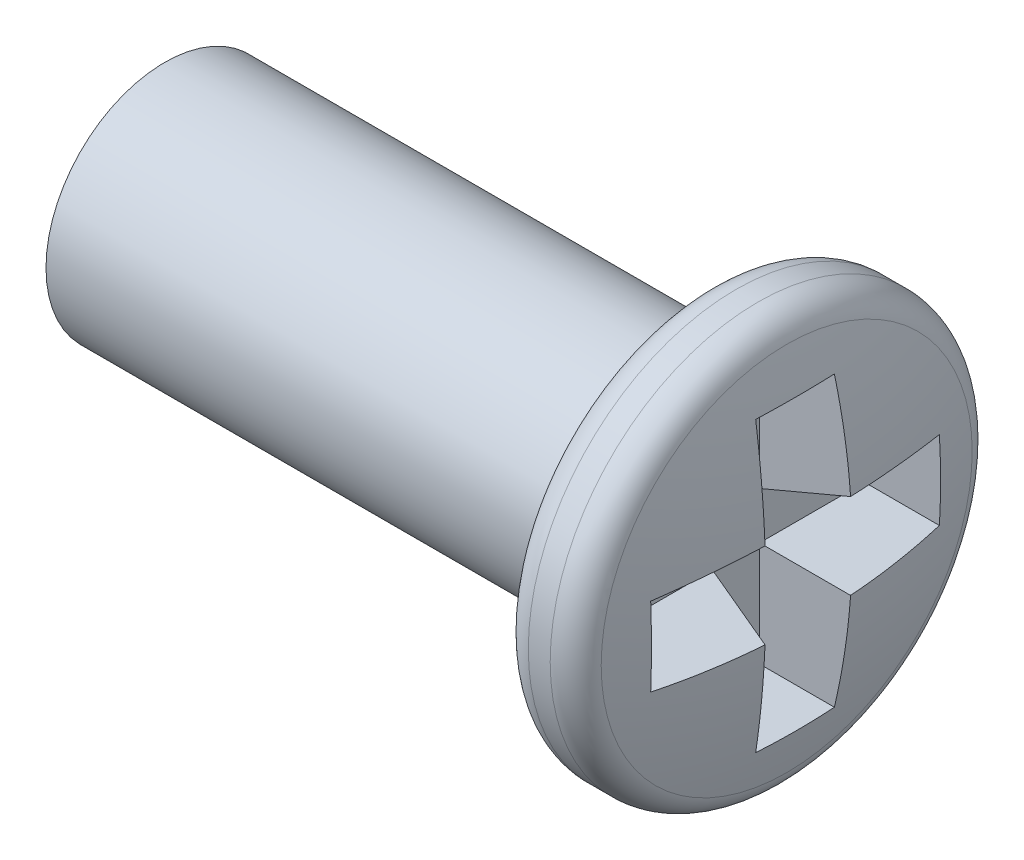
ISO-10303-21;
HEADER;
FILE_DESCRIPTION(('STEP AP214'),'2;1');
FILE_NAME('part.step','',(''),(''),'','','');
FILE_SCHEMA(('AUTOMOTIVE_DESIGN { 1 0 10303 214 1 1 1 1 }'));
ENDSEC;
DATA;
#1=APPLICATION_CONTEXT('core data for automotive mechanical design processes');
#2=APPLICATION_PROTOCOL_DEFINITION('international standard','automotive_design',2000,#1);
#3=PRODUCT_CONTEXT('',#1,'mechanical');
#4=PRODUCT('Part','Part','',(#3));
#5=PRODUCT_RELATED_PRODUCT_CATEGORY('part','',(#4));
#6=PRODUCT_DEFINITION_FORMATION('','',#4);
#7=PRODUCT_DEFINITION_CONTEXT('part definition',#1,'design');
#8=PRODUCT_DEFINITION('design','',#6,#7);
#9=PRODUCT_DEFINITION_SHAPE('','',#8);
#10=(LENGTH_UNIT() NAMED_UNIT(*) SI_UNIT(.MILLI.,.METRE.));
#11=(NAMED_UNIT(*) PLANE_ANGLE_UNIT() SI_UNIT($,.RADIAN.));
#12=(NAMED_UNIT(*) SI_UNIT($,.STERADIAN.) SOLID_ANGLE_UNIT());
#13=UNCERTAINTY_MEASURE_WITH_UNIT(LENGTH_MEASURE(1.E-05),#10,'distance_accuracy_value','');
#14=(GEOMETRIC_REPRESENTATION_CONTEXT(3) GLOBAL_UNCERTAINTY_ASSIGNED_CONTEXT((#13)) GLOBAL_UNIT_ASSIGNED_CONTEXT((#10,
#11,#12)) REPRESENTATION_CONTEXT('',''));
#15=CARTESIAN_POINT('',(0.,0.,0.));
#16=DIRECTION('',(0.,0.,1.));
#17=DIRECTION('',(1.,0.,0.));
#18=AXIS2_PLACEMENT_3D('',#15,#16,#17);
#19=CARTESIAN_POINT('',(0.,0.8,0.));
#20=DIRECTION('',(1.,0.,0.));
#21=DIRECTION('',(0.,0.,-1.));
#22=AXIS2_PLACEMENT_3D('',#19,#20,#21);
#23=PLANE('',#22);
#24=CARTESIAN_POINT('',(0.,0.,0.));
#25=DIRECTION('',(-1.,0.,0.));
#26=DIRECTION('',(0.,0.,1.));
#27=AXIS2_PLACEMENT_3D('',#24,#25,#26);
#28=CIRCLE('',#27,0.8);
#29=CARTESIAN_POINT('',(0.,0.,0.8));
#30=VERTEX_POINT('',#29);
#31=EDGE_CURVE('E127',#30,#30,#28,.T.);
#32=ORIENTED_EDGE('',*,*,#31,.T.);
#33=EDGE_LOOP('',(#32));
#34=FACE_BOUND('',#33,.T.);
#35=ADVANCED_FACE('F34',(#34),#23,.F.);
#36=CARTESIAN_POINT('',(-0.649999999999987,0.,0.));
#37=DIRECTION('',(-1.,0.,0.));
#38=DIRECTION('',(0.,1.,0.));
#39=AXIS2_PLACEMENT_3D('',#36,#37,#38);
#40=SPHERICAL_SURFACE('',#39,4.99999999999999);
#41=CARTESIAN_POINT('',(-0.388246241920137,0.,-0.976878324226091));
#42=DIRECTION('',(-0.258819045102521,0.,0.965925826289068));
#43=DIRECTION('',(0.965925826289068,0.,0.258819045102521));
#44=AXIS2_PLACEMENT_3D('',#41,#42,#43);
#45=CIRCLE('',#44,4.89665127508465);
#46=CARTESIAN_POINT('',(4.33335234348308,0.288270203716636,0.288270203716636));
#47=VERTEX_POINT('',#46);
#48=CARTESIAN_POINT('',(4.24733772425329,0.972491726120527,0.265222655956741));
#49=VERTEX_POINT('',#48);
#50=EDGE_CURVE('E193',#47,#49,#45,.T.);
#51=ORIENTED_EDGE('',*,*,#50,.T.);
#52=CARTESIAN_POINT('',(-0.565063509461084,-0.31698729810778,0.));
#53=DIRECTION('',(-0.258819045102521,0.965925826289068,0.));
#54=DIRECTION('',(-0.965925826289068,-0.258819045102521,0.));
#55=AXIS2_PLACEMENT_3D('',#52,#53,#54);
#56=CIRCLE('',#55,4.98921886124603);
#57=CARTESIAN_POINT('',(4.24733772425329,0.972491726120527,-0.265222655956741));
#58=VERTEX_POINT('',#57);
#59=EDGE_CURVE('E11',#49,#58,#56,.T.);
#60=ORIENTED_EDGE('',*,*,#59,.T.);
#61=CARTESIAN_POINT('',(-0.388246241920137,0.,0.976878324226092));
#62=DIRECTION('',(-0.258819045102521,0.,-0.965925826289068));
#63=DIRECTION('',(-0.965925826289068,0.,0.258819045102521));
#64=AXIS2_PLACEMENT_3D('',#61,#62,#63);
#65=CIRCLE('',#64,4.89665127508465);
#66=CARTESIAN_POINT('',(4.33335234348308,0.288270203716636,-0.288270203716636));
#67=VERTEX_POINT('',#66);
#68=EDGE_CURVE('E42',#58,#67,#65,.T.);
#69=ORIENTED_EDGE('',*,*,#68,.T.);
#70=CARTESIAN_POINT('',(-0.388246241920137,-0.976878324226091,0.));
#71=DIRECTION('',(-0.258819045102521,0.965925826289068,0.));
#72=DIRECTION('',(-0.965925826289068,-0.258819045102521,0.));
#73=AXIS2_PLACEMENT_3D('',#70,#71,#72);
#74=CIRCLE('',#73,4.89665127508465);
#75=CARTESIAN_POINT('',(4.24733772425329,0.265222655956742,-0.972491726120527));
#76=VERTEX_POINT('',#75);
#77=EDGE_CURVE('E221',#67,#76,#74,.T.);
#78=ORIENTED_EDGE('',*,*,#77,.T.);
#79=CARTESIAN_POINT('',(-0.565063509461084,0.,0.31698729810778));
#80=DIRECTION('',(-0.258819045102521,0.,-0.965925826289068));
#81=DIRECTION('',(-0.965925826289068,0.,0.258819045102521));
#82=AXIS2_PLACEMENT_3D('',#79,#80,#81);
#83=CIRCLE('',#82,4.98921886124603);
#84=CARTESIAN_POINT('',(4.24733772425329,-0.265222655956742,-0.972491726120527));
#85=VERTEX_POINT('',#84);
#86=EDGE_CURVE('E218',#76,#85,#83,.T.);
#87=ORIENTED_EDGE('',*,*,#86,.T.);
#88=CARTESIAN_POINT('',(-0.388246241920137,0.976878324226091,0.));
#89=DIRECTION('',(-0.258819045102521,-0.965925826289068,0.));
#90=DIRECTION('',(0.965925826289068,-0.258819045102521,0.));
#91=AXIS2_PLACEMENT_3D('',#88,#89,#90);
#92=CIRCLE('',#91,4.89665127508465);
#93=CARTESIAN_POINT('',(4.33335234348308,-0.288270203716636,-0.288270203716636));
#94=VERTEX_POINT('',#93);
#95=EDGE_CURVE('E215',#85,#94,#92,.T.);
#96=ORIENTED_EDGE('',*,*,#95,.T.);
#97=CARTESIAN_POINT('',(-0.388246241920137,0.,0.976878324226091));
#98=DIRECTION('',(-0.258819045102521,0.,-0.965925826289068));
#99=DIRECTION('',(-0.965925826289068,0.,0.258819045102521));
#100=AXIS2_PLACEMENT_3D('',#97,#98,#99);
#101=CIRCLE('',#100,4.89665127508465);
#102=CARTESIAN_POINT('',(4.24733772425329,-0.972491726120527,-0.265222655956742));
#103=VERTEX_POINT('',#102);
#104=EDGE_CURVE('E212',#94,#103,#101,.T.);
#105=ORIENTED_EDGE('',*,*,#104,.T.);
#106=CARTESIAN_POINT('',(-0.565063509461084,0.31698729810778,0.));
#107=DIRECTION('',(-0.258819045102521,-0.965925826289068,0.));
#108=DIRECTION('',(0.965925826289068,-0.258819045102521,0.));
#109=AXIS2_PLACEMENT_3D('',#106,#107,#108);
#110=CIRCLE('',#109,4.98921886124603);
#111=CARTESIAN_POINT('',(4.24733772425329,-0.972491726120527,0.265222655956742));
#112=VERTEX_POINT('',#111);
#113=EDGE_CURVE('E209',#103,#112,#110,.T.);
#114=ORIENTED_EDGE('',*,*,#113,.T.);
#115=CARTESIAN_POINT('',(-0.388246241920137,0.,-0.976878324226091));
#116=DIRECTION('',(-0.258819045102521,0.,0.965925826289068));
#117=DIRECTION('',(0.965925826289068,0.,0.258819045102521));
#118=AXIS2_PLACEMENT_3D('',#115,#116,#117);
#119=CIRCLE('',#118,4.89665127508465);
#120=CARTESIAN_POINT('',(4.33335234348308,-0.288270203716636,0.288270203716636));
#121=VERTEX_POINT('',#120);
#122=EDGE_CURVE('E206',#112,#121,#119,.T.);
#123=ORIENTED_EDGE('',*,*,#122,.T.);
#124=CARTESIAN_POINT('',(-0.388246241920137,0.976878324226091,0.));
#125=DIRECTION('',(-0.258819045102521,-0.965925826289068,0.));
#126=DIRECTION('',(0.965925826289068,-0.258819045102521,0.));
#127=AXIS2_PLACEMENT_3D('',#124,#125,#126);
#128=CIRCLE('',#127,4.89665127508465);
#129=CARTESIAN_POINT('',(4.24733772425329,-0.265222655956742,0.972491726120527));
#130=VERTEX_POINT('',#129);
#131=EDGE_CURVE('E203',#121,#130,#128,.T.);
#132=ORIENTED_EDGE('',*,*,#131,.T.);
#133=CARTESIAN_POINT('',(-0.565063509461084,0.,-0.31698729810778));
#134=DIRECTION('',(-0.258819045102521,0.,0.965925826289068));
#135=DIRECTION('',(0.965925826289068,0.,0.258819045102521));
#136=AXIS2_PLACEMENT_3D('',#133,#134,#135);
#137=CIRCLE('',#136,4.98921886124603);
#138=CARTESIAN_POINT('',(4.24733772425329,0.265222655956742,0.972491726120527));
#139=VERTEX_POINT('',#138);
#140=EDGE_CURVE('E199',#130,#139,#137,.T.);
#141=ORIENTED_EDGE('',*,*,#140,.T.);
#142=CARTESIAN_POINT('',(-0.388246241920137,-0.976878324226091,0.));
#143=DIRECTION('',(-0.258819045102521,0.965925826289068,0.));
#144=DIRECTION('',(-0.965925826289068,-0.258819045102521,0.));
#145=AXIS2_PLACEMENT_3D('',#142,#143,#144);
#146=CIRCLE('',#145,4.89665127508465);
#147=EDGE_CURVE('E196',#139,#47,#146,.T.);
#148=ORIENTED_EDGE('',*,*,#147,.T.);
#149=EDGE_LOOP('',(#51,#60,#69,#78,#87,#96,#105,#114,#123,#132,#141,#148));
#150=FACE_BOUND('',#149,.T.);
#151=CARTESIAN_POINT('',(4.19122918275927,0.,0.));
#152=DIRECTION('',(-1.,0.,0.));
#153=DIRECTION('',(0.,0.,1.));
#154=AXIS2_PLACEMENT_3D('',#151,#152,#153);
#155=CIRCLE('',#154,1.25);
#156=CARTESIAN_POINT('',(4.19122918275927,0.,1.25));
#157=VERTEX_POINT('',#156);
#158=EDGE_CURVE('E190',#157,#157,#155,.F.);
#159=ORIENTED_EDGE('',*,*,#158,.T.);
#160=EDGE_LOOP('',(#159));
#161=FACE_BOUND('',#160,.T.);
#162=ADVANCED_FACE('F224',(#150,#161),#40,.T.);
#163=CARTESIAN_POINT('',(-102.038169229657,0.,0.));
#164=DIRECTION('',(-1.,0.,0.));
#165=DIRECTION('',(0.,0.,1.));
#166=AXIS2_PLACEMENT_3D('',#163,#164,#165);
#167=CYLINDRICAL_SURFACE('',#166,1.4);
#168=CARTESIAN_POINT('',(3.85000000000001,0.,0.));
#169=DIRECTION('',(1.,0.,0.));
#170=DIRECTION('',(0.,0.,-1.));
#171=AXIS2_PLACEMENT_3D('',#168,#169,#170);
#172=CIRCLE('',#171,1.4);
#173=CARTESIAN_POINT('',(3.85000000000001,0.,-1.4));
#174=VERTEX_POINT('',#173);
#175=EDGE_CURVE('E186',#174,#174,#172,.T.);
#176=ORIENTED_EDGE('',*,*,#175,.T.);
#177=EDGE_LOOP('',(#176));
#178=FACE_BOUND('',#177,.T.);
#179=CARTESIAN_POINT('',(3.99758001544891,0.,0.));
#180=DIRECTION('',(-1.,0.,0.));
#181=DIRECTION('',(0.,0.,1.));
#182=AXIS2_PLACEMENT_3D('',#179,#180,#181);
#183=CIRCLE('',#182,1.4);
#184=CARTESIAN_POINT('',(3.99758001544891,0.,1.4));
#185=VERTEX_POINT('',#184);
#186=EDGE_CURVE('E182',#185,#185,#183,.T.);
#187=ORIENTED_EDGE('',*,*,#186,.T.);
#188=EDGE_LOOP('',(#187));
#189=FACE_BOUND('',#188,.T.);
#190=ADVANCED_FACE('F296',(#178,#189),#167,.T.);
#191=CARTESIAN_POINT('',(3.65,1.4,0.));
#192=DIRECTION('',(1.,0.,0.));
#193=DIRECTION('',(0.,0.,-1.));
#194=AXIS2_PLACEMENT_3D('',#191,#192,#193);
#195=PLANE('',#194);
#196=CARTESIAN_POINT('',(3.65,0.,0.));
#197=DIRECTION('',(1.,0.,0.));
#198=DIRECTION('',(0.,0.,-1.));
#199=AXIS2_PLACEMENT_3D('',#196,#197,#198);
#200=CIRCLE('',#199,1.2);
#201=CARTESIAN_POINT('',(3.65,0.,-1.2));
#202=VERTEX_POINT('',#201);
#203=EDGE_CURVE('E179',#202,#202,#200,.F.);
#204=ORIENTED_EDGE('',*,*,#203,.T.);
#205=EDGE_LOOP('',(#204));
#206=FACE_BOUND('',#205,.T.);
#207=CARTESIAN_POINT('',(3.65,0.,0.));
#208=DIRECTION('',(-1.,0.,0.));
#209=DIRECTION('',(0.,0.,1.));
#210=AXIS2_PLACEMENT_3D('',#207,#208,#209);
#211=CIRCLE('',#210,0.8);
#212=CARTESIAN_POINT('',(3.65,0.,0.8));
#213=VERTEX_POINT('',#212);
#214=EDGE_CURVE('E175',#213,#213,#211,.T.);
#215=ORIENTED_EDGE('',*,*,#214,.F.);
#216=EDGE_LOOP('',(#215));
#217=FACE_BOUND('',#216,.T.);
#218=ADVANCED_FACE('F308',(#206,#217),#195,.F.);
#219=CARTESIAN_POINT('',(-102.038169229657,0.,0.));
#220=DIRECTION('',(-1.,0.,0.));
#221=DIRECTION('',(0.,0.,1.));
#222=AXIS2_PLACEMENT_3D('',#219,#220,#221);
#223=CYLINDRICAL_SURFACE('',#222,0.8);
#224=ORIENTED_EDGE('',*,*,#31,.F.);
#225=EDGE_LOOP('',(#224));
#226=FACE_BOUND('',#225,.T.);
#227=ORIENTED_EDGE('',*,*,#214,.T.);
#228=EDGE_LOOP('',(#227));
#229=FACE_BOUND('',#228,.T.);
#230=ADVANCED_FACE('F301',(#226,#229),#223,.T.);
#231=CARTESIAN_POINT('',(3.85000000000001,0.,0.));
#232=DIRECTION('',(1.,0.,0.));
#233=DIRECTION('',(0.,0.,-1.));
#234=AXIS2_PLACEMENT_3D('',#231,#232,#233);
#235=TOROIDAL_SURFACE('',#234,1.2,0.2);
#236=ORIENTED_EDGE('',*,*,#175,.F.);
#237=EDGE_LOOP('',(#236));
#238=FACE_BOUND('',#237,.T.);
#239=ORIENTED_EDGE('',*,*,#203,.F.);
#240=EDGE_LOOP('',(#239));
#241=FACE_BOUND('',#240,.T.);
#242=ADVANCED_FACE('F299',(#238,#241),#235,.T.);
#243=CARTESIAN_POINT('',(3.9975800154489,0.,0.));
#244=DIRECTION('',(-1.,0.,0.));
#245=DIRECTION('',(0.,0.,1.));
#246=AXIS2_PLACEMENT_3D('',#243,#244,#245);
#247=TOROIDAL_SURFACE('',#246,1.2,0.2);
#248=ORIENTED_EDGE('',*,*,#158,.F.);
#249=EDGE_LOOP('',(#248));
#250=FACE_BOUND('',#249,.T.);
#251=ORIENTED_EDGE('',*,*,#186,.F.);
#252=EDGE_LOOP('',(#251));
#253=FACE_BOUND('',#252,.T.);
#254=ADVANCED_FACE('F36',(#250,#253),#247,.T.);
#255=CARTESIAN_POINT('',(4.35,1.,0.292730929836214));
#256=DIRECTION('',(-0.258819045102521,0.965925826289068,0.));
#257=DIRECTION('',(-0.965925826289068,-0.258819045102521,0.));
#258=AXIS2_PLACEMENT_3D('',#255,#256,#257);
#259=PLANE('',#258);
#260=DIRECTION('',(0.935113126531029,0.250562807085732,0.250562807085732));
#261=VECTOR('',#260,1.);
#262=CARTESIAN_POINT('',(4.35,1.,0.292730929836214));
#263=LINE('',#262,#261);
#264=CARTESIAN_POINT('',(3.85,0.866025403784438,0.158756333620653));
#265=VERTEX_POINT('',#264);
#266=EDGE_CURVE('E49',#265,#49,#263,.T.);
#267=ORIENTED_EDGE('',*,*,#266,.F.);
#268=DIRECTION('',(0.,0.,1.));
#269=VECTOR('',#268,1.);
#270=CARTESIAN_POINT('',(3.85,0.866025403784438,0.292730929836214));
#271=LINE('',#270,#269);
#272=CARTESIAN_POINT('',(3.85,0.866025403784438,-0.158756333620653));
#273=VERTEX_POINT('',#272);
#274=EDGE_CURVE('E131',#273,#265,#271,.T.);
#275=ORIENTED_EDGE('',*,*,#274,.F.);
#276=DIRECTION('',(0.935113126531029,0.250562807085732,-0.250562807085732));
#277=VECTOR('',#276,1.);
#278=CARTESIAN_POINT('',(4.35,1.,-0.292730929836215));
#279=LINE('',#278,#277);
#280=EDGE_CURVE('E121',#273,#58,#279,.T.);
#281=ORIENTED_EDGE('',*,*,#280,.T.);
#282=ORIENTED_EDGE('',*,*,#59,.F.);
#283=EDGE_LOOP('',(#267,#275,#281,#282));
#284=FACE_BOUND('',#283,.T.);
#285=ADVANCED_FACE('F132',(#284),#259,.F.);
#286=CARTESIAN_POINT('',(4.35,1.,-0.292730929836215));
#287=DIRECTION('',(-0.258819045102521,0.,-0.965925826289068));
#288=DIRECTION('',(-0.965925826289068,0.,0.258819045102521));
#289=AXIS2_PLACEMENT_3D('',#286,#287,#288);
#290=PLANE('',#289);
#291=ORIENTED_EDGE('',*,*,#280,.F.);
#292=DIRECTION('',(0.,1.,0.));
#293=VECTOR('',#292,1.);
#294=CARTESIAN_POINT('',(3.85,1.,-0.158756333620653));
#295=LINE('',#294,#293);
#296=CARTESIAN_POINT('',(3.85,0.158756333620653,-0.158756333620653));
#297=VERTEX_POINT('',#296);
#298=EDGE_CURVE('E125',#297,#273,#295,.T.);
#299=ORIENTED_EDGE('',*,*,#298,.F.);
#300=DIRECTION('',(0.935113126531029,0.250562807085732,-0.250562807085732));
#301=VECTOR('',#300,1.);
#302=CARTESIAN_POINT('',(4.51571637530692,0.337134498772317,-0.337134498772317));
#303=LINE('',#302,#301);
#304=EDGE_CURVE('E128',#297,#67,#303,.T.);
#305=ORIENTED_EDGE('',*,*,#304,.T.);
#306=ORIENTED_EDGE('',*,*,#68,.F.);
#307=EDGE_LOOP('',(#291,#299,#305,#306));
#308=FACE_BOUND('',#307,.T.);
#309=ADVANCED_FACE('F123',(#308),#290,.F.);
#310=CARTESIAN_POINT('',(4.35,0.292730929836215,-0.292730929836214));
#311=DIRECTION('',(-0.258819045102521,0.965925826289068,0.));
#312=DIRECTION('',(-0.965925826289068,-0.258819045102521,0.));
#313=AXIS2_PLACEMENT_3D('',#310,#311,#312);
#314=PLANE('',#313);
#315=ORIENTED_EDGE('',*,*,#304,.F.);
#316=DIRECTION('',(0.,0.,1.));
#317=VECTOR('',#316,1.);
#318=CARTESIAN_POINT('',(3.85,0.158756333620653,-0.292730929836214));
#319=LINE('',#318,#317);
#320=CARTESIAN_POINT('',(3.85,0.158756333620653,-0.866025403784438));
#321=VERTEX_POINT('',#320);
#322=EDGE_CURVE('E141',#321,#297,#319,.T.);
#323=ORIENTED_EDGE('',*,*,#322,.F.);
#324=DIRECTION('',(0.935113126531029,0.250562807085732,-0.250562807085732));
#325=VECTOR('',#324,1.);
#326=CARTESIAN_POINT('',(4.35,0.292730929836215,-1.));
#327=LINE('',#326,#325);
#328=EDGE_CURVE('E256',#321,#76,#327,.T.);
#329=ORIENTED_EDGE('',*,*,#328,.T.);
#330=ORIENTED_EDGE('',*,*,#77,.F.);
#331=EDGE_LOOP('',(#315,#323,#329,#330));
#332=FACE_BOUND('',#331,.T.);
#333=ADVANCED_FACE('F260',(#332),#314,.F.);
#334=CARTESIAN_POINT('',(4.35,0.292730929836215,-1.));
#335=DIRECTION('',(-0.258819045102521,0.,-0.965925826289068));
#336=DIRECTION('',(-0.965925826289068,0.,0.258819045102521));
#337=AXIS2_PLACEMENT_3D('',#334,#335,#336);
#338=PLANE('',#337);
#339=ORIENTED_EDGE('',*,*,#328,.F.);
#340=DIRECTION('',(0.,1.,0.));
#341=VECTOR('',#340,1.);
#342=CARTESIAN_POINT('',(3.85,0.292730929836215,-0.866025403784438));
#343=LINE('',#342,#341);
#344=CARTESIAN_POINT('',(3.85,-0.158756333620653,-0.866025403784438));
#345=VERTEX_POINT('',#344);
#346=EDGE_CURVE('E145',#345,#321,#343,.T.);
#347=ORIENTED_EDGE('',*,*,#346,.F.);
#348=DIRECTION('',(0.935113126531029,-0.250562807085732,-0.250562807085732));
#349=VECTOR('',#348,1.);
#350=CARTESIAN_POINT('',(4.35,-0.292730929836214,-1.));
#351=LINE('',#350,#349);
#352=EDGE_CURVE('E252',#345,#85,#351,.T.);
#353=ORIENTED_EDGE('',*,*,#352,.T.);
#354=ORIENTED_EDGE('',*,*,#86,.F.);
#355=EDGE_LOOP('',(#339,#347,#353,#354));
#356=FACE_BOUND('',#355,.T.);
#357=ADVANCED_FACE('F263',(#356),#338,.F.);
#358=CARTESIAN_POINT('',(4.35,-0.292730929836214,-1.));
#359=DIRECTION('',(-0.258819045102521,-0.965925826289068,0.));
#360=DIRECTION('',(0.965925826289068,-0.258819045102521,0.));
#361=AXIS2_PLACEMENT_3D('',#358,#359,#360);
#362=PLANE('',#361);
#363=ORIENTED_EDGE('',*,*,#352,.F.);
#364=DIRECTION('',(0.,0.,-1.));
#365=VECTOR('',#364,1.);
#366=CARTESIAN_POINT('',(3.85,-0.158756333620653,-1.));
#367=LINE('',#366,#365);
#368=CARTESIAN_POINT('',(3.85,-0.158756333620653,-0.158756333620653));
#369=VERTEX_POINT('',#368);
#370=EDGE_CURVE('E150',#369,#345,#367,.T.);
#371=ORIENTED_EDGE('',*,*,#370,.F.);
#372=DIRECTION('',(0.935113126531029,-0.250562807085732,-0.250562807085732));
#373=VECTOR('',#372,1.);
#374=CARTESIAN_POINT('',(4.51571637530692,-0.337134498772317,-0.337134498772317));
#375=LINE('',#374,#373);
#376=EDGE_CURVE('E249',#369,#94,#375,.T.);
#377=ORIENTED_EDGE('',*,*,#376,.T.);
#378=ORIENTED_EDGE('',*,*,#95,.F.);
#379=EDGE_LOOP('',(#363,#371,#377,#378));
#380=FACE_BOUND('',#379,.T.);
#381=ADVANCED_FACE('F265',(#380),#362,.F.);
#382=CARTESIAN_POINT('',(4.35,-0.292730929836215,-0.292730929836214));
#383=DIRECTION('',(-0.258819045102521,0.,-0.965925826289068));
#384=DIRECTION('',(-0.965925826289068,0.,0.258819045102521));
#385=AXIS2_PLACEMENT_3D('',#382,#383,#384);
#386=PLANE('',#385);
#387=ORIENTED_EDGE('',*,*,#376,.F.);
#388=DIRECTION('',(0.,1.,0.));
#389=VECTOR('',#388,1.);
#390=CARTESIAN_POINT('',(3.85,-0.292730929836215,-0.158756333620653));
#391=LINE('',#390,#389);
#392=CARTESIAN_POINT('',(3.85,-0.866025403784438,-0.158756333620653));
#393=VERTEX_POINT('',#392);
#394=EDGE_CURVE('E153',#393,#369,#391,.T.);
#395=ORIENTED_EDGE('',*,*,#394,.F.);
#396=DIRECTION('',(0.935113126531029,-0.250562807085732,-0.250562807085732));
#397=VECTOR('',#396,1.);
#398=CARTESIAN_POINT('',(4.35,-1.,-0.292730929836215));
#399=LINE('',#398,#397);
#400=EDGE_CURVE('E246',#393,#103,#399,.T.);
#401=ORIENTED_EDGE('',*,*,#400,.T.);
#402=ORIENTED_EDGE('',*,*,#104,.F.);
#403=EDGE_LOOP('',(#387,#395,#401,#402));
#404=FACE_BOUND('',#403,.T.);
#405=ADVANCED_FACE('F269',(#404),#386,.F.);
#406=CARTESIAN_POINT('',(4.35,-1.,-0.292730929836215));
#407=DIRECTION('',(-0.258819045102521,-0.965925826289068,0.));
#408=DIRECTION('',(0.965925826289068,-0.258819045102521,0.));
#409=AXIS2_PLACEMENT_3D('',#406,#407,#408);
#410=PLANE('',#409);
#411=ORIENTED_EDGE('',*,*,#400,.F.);
#412=DIRECTION('',(0.,0.,-1.));
#413=VECTOR('',#412,1.);
#414=CARTESIAN_POINT('',(3.85,-0.866025403784438,-0.292730929836215));
#415=LINE('',#414,#413);
#416=CARTESIAN_POINT('',(3.85,-0.866025403784438,0.158756333620653));
#417=VERTEX_POINT('',#416);
#418=EDGE_CURVE('E156',#417,#393,#415,.T.);
#419=ORIENTED_EDGE('',*,*,#418,.F.);
#420=DIRECTION('',(0.935113126531029,-0.250562807085732,0.250562807085732));
#421=VECTOR('',#420,1.);
#422=CARTESIAN_POINT('',(4.35,-1.,0.292730929836214));
#423=LINE('',#422,#421);
#424=EDGE_CURVE('E243',#417,#112,#423,.T.);
#425=ORIENTED_EDGE('',*,*,#424,.T.);
#426=ORIENTED_EDGE('',*,*,#113,.F.);
#427=EDGE_LOOP('',(#411,#419,#425,#426));
#428=FACE_BOUND('',#427,.T.);
#429=ADVANCED_FACE('F272',(#428),#410,.F.);
#430=CARTESIAN_POINT('',(4.35,-1.,0.292730929836214));
#431=DIRECTION('',(-0.258819045102521,0.,0.965925826289068));
#432=DIRECTION('',(0.965925826289068,0.,0.258819045102521));
#433=AXIS2_PLACEMENT_3D('',#430,#431,#432);
#434=PLANE('',#433);
#435=ORIENTED_EDGE('',*,*,#424,.F.);
#436=DIRECTION('',(0.,-1.,0.));
#437=VECTOR('',#436,1.);
#438=CARTESIAN_POINT('',(3.85,-1.,0.158756333620653));
#439=LINE('',#438,#437);
#440=CARTESIAN_POINT('',(3.85,-0.158756333620653,0.158756333620653));
#441=VERTEX_POINT('',#440);
#442=EDGE_CURVE('E159',#441,#417,#439,.T.);
#443=ORIENTED_EDGE('',*,*,#442,.F.);
#444=DIRECTION('',(0.935113126531029,-0.250562807085732,0.250562807085732));
#445=VECTOR('',#444,1.);
#446=CARTESIAN_POINT('',(4.51571637530692,-0.337134498772317,0.337134498772317));
#447=LINE('',#446,#445);
#448=EDGE_CURVE('E240',#441,#121,#447,.T.);
#449=ORIENTED_EDGE('',*,*,#448,.T.);
#450=ORIENTED_EDGE('',*,*,#122,.F.);
#451=EDGE_LOOP('',(#435,#443,#449,#450));
#452=FACE_BOUND('',#451,.T.);
#453=ADVANCED_FACE('F274',(#452),#434,.F.);
#454=CARTESIAN_POINT('',(4.35,-0.292730929836214,0.292730929836214));
#455=DIRECTION('',(-0.258819045102521,-0.965925826289068,0.));
#456=DIRECTION('',(0.965925826289068,-0.258819045102521,0.));
#457=AXIS2_PLACEMENT_3D('',#454,#455,#456);
#458=PLANE('',#457);
#459=ORIENTED_EDGE('',*,*,#448,.F.);
#460=DIRECTION('',(0.,0.,-1.));
#461=VECTOR('',#460,1.);
#462=CARTESIAN_POINT('',(3.85,-0.158756333620653,0.292730929836214));
#463=LINE('',#462,#461);
#464=CARTESIAN_POINT('',(3.85,-0.158756333620653,0.866025403784438));
#465=VERTEX_POINT('',#464);
#466=EDGE_CURVE('E162',#465,#441,#463,.T.);
#467=ORIENTED_EDGE('',*,*,#466,.F.);
#468=DIRECTION('',(0.935113126531029,-0.250562807085732,0.250562807085732));
#469=VECTOR('',#468,1.);
#470=CARTESIAN_POINT('',(4.35,-0.292730929836214,1.));
#471=LINE('',#470,#469);
#472=EDGE_CURVE('E234',#465,#130,#471,.T.);
#473=ORIENTED_EDGE('',*,*,#472,.T.);
#474=ORIENTED_EDGE('',*,*,#131,.F.);
#475=EDGE_LOOP('',(#459,#467,#473,#474));
#476=FACE_BOUND('',#475,.T.);
#477=ADVANCED_FACE('F278',(#476),#458,.F.);
#478=CARTESIAN_POINT('',(4.35,-0.292730929836214,1.));
#479=DIRECTION('',(-0.258819045102521,0.,0.965925826289068));
#480=DIRECTION('',(0.965925826289068,0.,0.258819045102521));
#481=AXIS2_PLACEMENT_3D('',#478,#479,#480);
#482=PLANE('',#481);
#483=ORIENTED_EDGE('',*,*,#472,.F.);
#484=DIRECTION('',(0.,-1.,0.));
#485=VECTOR('',#484,1.);
#486=CARTESIAN_POINT('',(3.85,-0.292730929836214,0.866025403784438));
#487=LINE('',#486,#485);
#488=CARTESIAN_POINT('',(3.85,0.158756333620653,0.866025403784438));
#489=VERTEX_POINT('',#488);
#490=EDGE_CURVE('E166',#489,#465,#487,.T.);
#491=ORIENTED_EDGE('',*,*,#490,.F.);
#492=DIRECTION('',(0.935113126531029,0.250562807085732,0.250562807085732));
#493=VECTOR('',#492,1.);
#494=CARTESIAN_POINT('',(4.35,0.292730929836215,1.));
#495=LINE('',#494,#493);
#496=EDGE_CURVE('E232',#489,#139,#495,.T.);
#497=ORIENTED_EDGE('',*,*,#496,.T.);
#498=ORIENTED_EDGE('',*,*,#140,.F.);
#499=EDGE_LOOP('',(#483,#491,#497,#498));
#500=FACE_BOUND('',#499,.T.);
#501=ADVANCED_FACE('F281',(#500),#482,.F.);
#502=CARTESIAN_POINT('',(4.35,0.292730929836215,1.));
#503=DIRECTION('',(-0.258819045102521,0.965925826289068,0.));
#504=DIRECTION('',(-0.965925826289068,-0.258819045102521,0.));
#505=AXIS2_PLACEMENT_3D('',#502,#503,#504);
#506=PLANE('',#505);
#507=ORIENTED_EDGE('',*,*,#496,.F.);
#508=DIRECTION('',(0.,0.,1.));
#509=VECTOR('',#508,1.);
#510=CARTESIAN_POINT('',(3.85,0.158756333620653,1.));
#511=LINE('',#510,#509);
#512=CARTESIAN_POINT('',(3.85,0.158756333620653,0.158756333620653));
#513=VERTEX_POINT('',#512);
#514=EDGE_CURVE('E169',#513,#489,#511,.T.);
#515=ORIENTED_EDGE('',*,*,#514,.F.);
#516=DIRECTION('',(0.935113126531029,0.250562807085732,0.250562807085732));
#517=VECTOR('',#516,1.);
#518=CARTESIAN_POINT('',(4.51571637530692,0.337134498772317,0.337134498772317));
#519=LINE('',#518,#517);
#520=EDGE_CURVE('E143',#513,#47,#519,.T.);
#521=ORIENTED_EDGE('',*,*,#520,.T.);
#522=ORIENTED_EDGE('',*,*,#147,.F.);
#523=EDGE_LOOP('',(#507,#515,#521,#522));
#524=FACE_BOUND('',#523,.T.);
#525=ADVANCED_FACE('F230',(#524),#506,.F.);
#526=CARTESIAN_POINT('',(4.35,0.292730929836215,0.292730929836214));
#527=DIRECTION('',(-0.258819045102521,0.,0.965925826289068));
#528=DIRECTION('',(0.965925826289068,0.,0.258819045102521));
#529=AXIS2_PLACEMENT_3D('',#526,#527,#528);
#530=PLANE('',#529);
#531=ORIENTED_EDGE('',*,*,#520,.F.);
#532=DIRECTION('',(0.,-1.,0.));
#533=VECTOR('',#532,1.);
#534=CARTESIAN_POINT('',(3.85,0.292730929836215,0.158756333620653));
#535=LINE('',#534,#533);
#536=EDGE_CURVE('E135',#265,#513,#535,.T.);
#537=ORIENTED_EDGE('',*,*,#536,.F.);
#538=ORIENTED_EDGE('',*,*,#266,.T.);
#539=ORIENTED_EDGE('',*,*,#50,.F.);
#540=EDGE_LOOP('',(#531,#537,#538,#539));
#541=FACE_BOUND('',#540,.T.);
#542=ADVANCED_FACE('F227',(#541),#530,.F.);
#543=CARTESIAN_POINT('',(3.85,0.,0.));
#544=DIRECTION('',(-1.,0.,0.));
#545=DIRECTION('',(0.,0.,1.));
#546=AXIS2_PLACEMENT_3D('',#543,#544,#545);
#547=PLANE('',#546);
#548=ORIENTED_EDGE('',*,*,#274,.T.);
#549=ORIENTED_EDGE('',*,*,#536,.T.);
#550=ORIENTED_EDGE('',*,*,#514,.T.);
#551=ORIENTED_EDGE('',*,*,#490,.T.);
#552=ORIENTED_EDGE('',*,*,#466,.T.);
#553=ORIENTED_EDGE('',*,*,#442,.T.);
#554=ORIENTED_EDGE('',*,*,#418,.T.);
#555=ORIENTED_EDGE('',*,*,#394,.T.);
#556=ORIENTED_EDGE('',*,*,#370,.T.);
#557=ORIENTED_EDGE('',*,*,#346,.T.);
#558=ORIENTED_EDGE('',*,*,#322,.T.);
#559=ORIENTED_EDGE('',*,*,#298,.T.);
#560=EDGE_LOOP('',(#548,#549,#550,#551,#552,#553,#554,#555,#556,#557,#558,#559));
#561=FACE_BOUND('',#560,.T.);
#562=ADVANCED_FACE('F138',(#561),#547,.F.);
#563=CLOSED_SHELL('',(#35,#162,#190,#218,#230,#242,#254,#285,#309,#333,#357,#381,#405,#429,#453,
#477,#501,#525,#542,#562));
#564=MANIFOLD_SOLID_BREP('B2',#563);
#565=ADVANCED_BREP_SHAPE_REPRESENTATION('',(#18,#564),#14);
#566=SHAPE_DEFINITION_REPRESENTATION(#9,#565);
ENDSEC;
END-ISO-10303-21;
